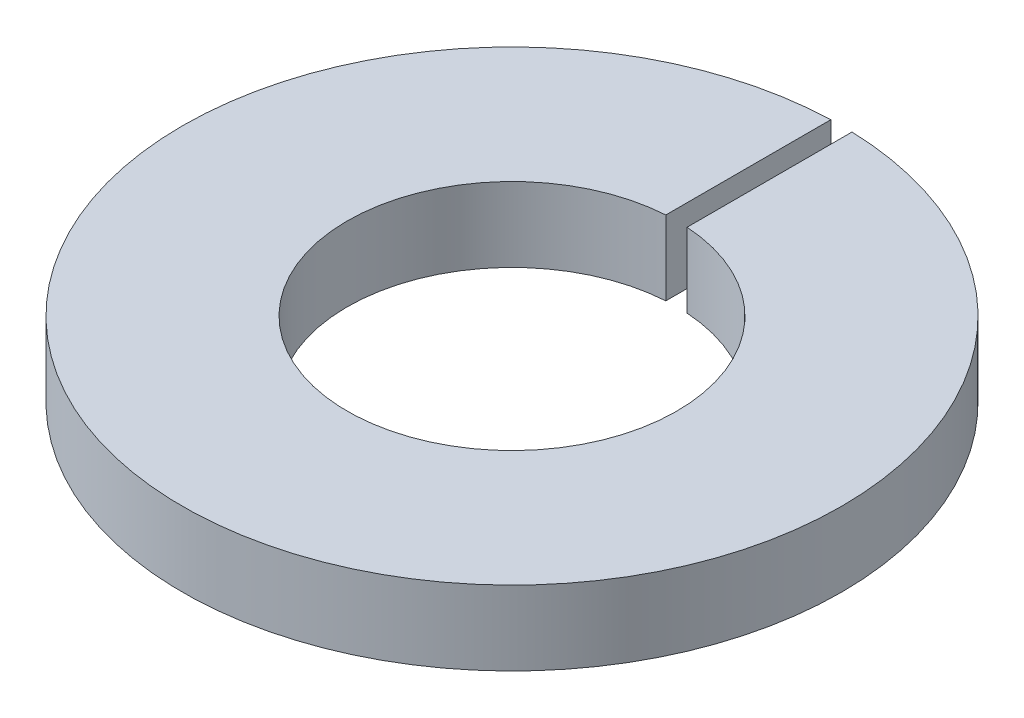
ISO-10303-21;
HEADER;
FILE_DESCRIPTION(('STEP AP214'),'2;1');
FILE_NAME('part.step','',(''),(''),'','','');
FILE_SCHEMA(('AUTOMOTIVE_DESIGN { 1 0 10303 214 1 1 1 1 }'));
ENDSEC;
DATA;
#1=APPLICATION_CONTEXT('core data for automotive mechanical design processes');
#2=APPLICATION_PROTOCOL_DEFINITION('international standard','automotive_design',2000,#1);
#3=PRODUCT_CONTEXT('',#1,'mechanical');
#4=PRODUCT('Part','Part','',(#3));
#5=PRODUCT_RELATED_PRODUCT_CATEGORY('part','',(#4));
#6=PRODUCT_DEFINITION_FORMATION('','',#4);
#7=PRODUCT_DEFINITION_CONTEXT('part definition',#1,'design');
#8=PRODUCT_DEFINITION('design','',#6,#7);
#9=PRODUCT_DEFINITION_SHAPE('','',#8);
#10=(LENGTH_UNIT() NAMED_UNIT(*) SI_UNIT(.MILLI.,.METRE.));
#11=(NAMED_UNIT(*) PLANE_ANGLE_UNIT() SI_UNIT($,.RADIAN.));
#12=(NAMED_UNIT(*) SI_UNIT($,.STERADIAN.) SOLID_ANGLE_UNIT());
#13=UNCERTAINTY_MEASURE_WITH_UNIT(LENGTH_MEASURE(1.E-05),#10,'distance_accuracy_value','');
#14=(GEOMETRIC_REPRESENTATION_CONTEXT(3) GLOBAL_UNCERTAINTY_ASSIGNED_CONTEXT((#13)) GLOBAL_UNIT_ASSIGNED_CONTEXT((#10,
#11,#12)) REPRESENTATION_CONTEXT('',''));
#15=CARTESIAN_POINT('',(0.,0.,0.));
#16=DIRECTION('',(0.,0.,1.));
#17=DIRECTION('',(1.,0.,0.));
#18=AXIS2_PLACEMENT_3D('',#15,#16,#17);
#19=CARTESIAN_POINT('',(0.,0.7,0.));
#20=DIRECTION('',(0.,-1.,0.));
#21=DIRECTION('',(0.,0.,-1.));
#22=AXIS2_PLACEMENT_3D('',#19,#20,#21);
#23=CYLINDRICAL_SURFACE('',#22,1.55);
#24=CARTESIAN_POINT('',(0.,0.,0.));
#25=DIRECTION('',(0.,-1.,0.));
#26=DIRECTION('',(0.,0.,1.));
#27=AXIS2_PLACEMENT_3D('',#24,#25,#26);
#28=CIRCLE('',#27,1.55);
#29=CARTESIAN_POINT('',(0.100000000000001,0.,-1.5467708298258));
#30=VERTEX_POINT('',#29);
#31=CARTESIAN_POINT('',(-0.0999999999999989,0.,-1.5467708298258));
#32=VERTEX_POINT('',#31);
#33=EDGE_CURVE('E107',#30,#32,#28,.T.);
#34=ORIENTED_EDGE('',*,*,#33,.T.);
#35=DIRECTION('',(0.,-1.,0.));
#36=VECTOR('',#35,1.);
#37=CARTESIAN_POINT('',(-0.0999999999999989,0.7,-1.5467708298258));
#38=LINE('',#37,#36);
#39=CARTESIAN_POINT('',(-0.0999999999999989,0.7,-1.5467708298258));
#40=VERTEX_POINT('',#39);
#41=EDGE_CURVE('E11',#40,#32,#38,.T.);
#42=ORIENTED_EDGE('',*,*,#41,.F.);
#43=CARTESIAN_POINT('',(0.,0.7,0.));
#44=DIRECTION('',(0.,-1.,0.));
#45=DIRECTION('',(0.,0.,1.));
#46=AXIS2_PLACEMENT_3D('',#43,#44,#45);
#47=CIRCLE('',#46,1.55);
#48=CARTESIAN_POINT('',(0.100000000000001,0.7,-1.5467708298258));
#49=VERTEX_POINT('',#48);
#50=EDGE_CURVE('E91',#49,#40,#47,.T.);
#51=ORIENTED_EDGE('',*,*,#50,.F.);
#52=DIRECTION('',(0.,-1.,0.));
#53=VECTOR('',#52,1.);
#54=CARTESIAN_POINT('',(0.100000000000001,0.7,-1.5467708298258));
#55=LINE('',#54,#53);
#56=EDGE_CURVE('E103',#49,#30,#55,.T.);
#57=ORIENTED_EDGE('',*,*,#56,.T.);
#58=EDGE_LOOP('',(#34,#42,#51,#57));
#59=FACE_BOUND('',#58,.T.);
#60=ADVANCED_FACE('F39',(#59),#23,.F.);
#61=CARTESIAN_POINT('',(-0.0999999999999989,0.7,-3.09838667696593));
#62=DIRECTION('',(-1.,0.,0.));
#63=DIRECTION('',(0.,0.,1.));
#64=AXIS2_PLACEMENT_3D('',#61,#62,#63);
#65=PLANE('',#64);
#66=DIRECTION('',(0.,0.,-1.));
#67=VECTOR('',#66,1.);
#68=CARTESIAN_POINT('',(-0.0999999999999989,0.,-3.09838667696593));
#69=LINE('',#68,#67);
#70=CARTESIAN_POINT('',(-0.0999999999999989,0.,-3.09838667696593));
#71=VERTEX_POINT('',#70);
#72=EDGE_CURVE('E96',#32,#71,#69,.T.);
#73=ORIENTED_EDGE('',*,*,#72,.T.);
#74=DIRECTION('',(0.,-1.,0.));
#75=VECTOR('',#74,1.);
#76=CARTESIAN_POINT('',(-0.0999999999999989,0.7,-3.09838667696593));
#77=LINE('',#76,#75);
#78=CARTESIAN_POINT('',(-0.0999999999999989,0.7,-3.09838667696593));
#79=VERTEX_POINT('',#78);
#80=EDGE_CURVE('E48',#79,#71,#77,.T.);
#81=ORIENTED_EDGE('',*,*,#80,.F.);
#82=DIRECTION('',(0.,0.,-1.));
#83=VECTOR('',#82,1.);
#84=CARTESIAN_POINT('',(-0.0999999999999989,0.7,-3.09838667696593));
#85=LINE('',#84,#83);
#86=EDGE_CURVE('E86',#40,#79,#85,.T.);
#87=ORIENTED_EDGE('',*,*,#86,.F.);
#88=ORIENTED_EDGE('',*,*,#41,.T.);
#89=EDGE_LOOP('',(#73,#81,#87,#88));
#90=FACE_BOUND('',#89,.T.);
#91=ADVANCED_FACE('F95',(#90),#65,.F.);
#92=CARTESIAN_POINT('',(0.,0.7,0.));
#93=DIRECTION('',(0.,-1.,0.));
#94=DIRECTION('',(0.,0.,-1.));
#95=AXIS2_PLACEMENT_3D('',#92,#93,#94);
#96=CYLINDRICAL_SURFACE('',#95,3.1);
#97=CARTESIAN_POINT('',(0.,0.,0.));
#98=DIRECTION('',(0.,1.,0.));
#99=DIRECTION('',(0.,0.,1.));
#100=AXIS2_PLACEMENT_3D('',#97,#98,#99);
#101=CIRCLE('',#100,3.1);
#102=CARTESIAN_POINT('',(0.100000000000003,0.,-3.09838667696593));
#103=VERTEX_POINT('',#102);
#104=EDGE_CURVE('E73',#71,#103,#101,.T.);
#105=ORIENTED_EDGE('',*,*,#104,.T.);
#106=DIRECTION('',(0.,-1.,0.));
#107=VECTOR('',#106,1.);
#108=CARTESIAN_POINT('',(0.100000000000003,0.7,-3.09838667696593));
#109=LINE('',#108,#107);
#110=CARTESIAN_POINT('',(0.100000000000003,0.7,-3.09838667696593));
#111=VERTEX_POINT('',#110);
#112=EDGE_CURVE('E98',#111,#103,#109,.T.);
#113=ORIENTED_EDGE('',*,*,#112,.F.);
#114=CARTESIAN_POINT('',(0.,0.7,0.));
#115=DIRECTION('',(0.,1.,0.));
#116=DIRECTION('',(0.,0.,1.));
#117=AXIS2_PLACEMENT_3D('',#114,#115,#116);
#118=CIRCLE('',#117,3.1);
#119=EDGE_CURVE('E89',#79,#111,#118,.T.);
#120=ORIENTED_EDGE('',*,*,#119,.F.);
#121=ORIENTED_EDGE('',*,*,#80,.T.);
#122=EDGE_LOOP('',(#105,#113,#120,#121));
#123=FACE_BOUND('',#122,.T.);
#124=ADVANCED_FACE('F99',(#123),#96,.T.);
#125=CARTESIAN_POINT('',(0.100000000000001,0.7,-3.09838667696593));
#126=DIRECTION('',(1.,0.,0.));
#127=DIRECTION('',(0.,0.,-1.));
#128=AXIS2_PLACEMENT_3D('',#125,#126,#127);
#129=PLANE('',#128);
#130=DIRECTION('',(0.,0.,1.));
#131=VECTOR('',#130,1.);
#132=CARTESIAN_POINT('',(0.100000000000001,0.,-3.09838667696593));
#133=LINE('',#132,#131);
#134=EDGE_CURVE('E79',#103,#30,#133,.T.);
#135=ORIENTED_EDGE('',*,*,#134,.T.);
#136=ORIENTED_EDGE('',*,*,#56,.F.);
#137=DIRECTION('',(0.,0.,1.));
#138=VECTOR('',#137,1.);
#139=CARTESIAN_POINT('',(0.100000000000001,0.7,-3.09838667696593));
#140=LINE('',#139,#138);
#141=EDGE_CURVE('E56',#111,#49,#140,.T.);
#142=ORIENTED_EDGE('',*,*,#141,.F.);
#143=ORIENTED_EDGE('',*,*,#112,.T.);
#144=EDGE_LOOP('',(#135,#136,#142,#143));
#145=FACE_BOUND('',#144,.T.);
#146=ADVANCED_FACE('F120',(#145),#129,.F.);
#147=CARTESIAN_POINT('',(0.,0.7,0.));
#148=DIRECTION('',(0.,1.,0.));
#149=DIRECTION('',(0.,0.,1.));
#150=AXIS2_PLACEMENT_3D('',#147,#148,#149);
#151=PLANE('',#150);
#152=ORIENTED_EDGE('',*,*,#50,.T.);
#153=ORIENTED_EDGE('',*,*,#86,.T.);
#154=ORIENTED_EDGE('',*,*,#119,.T.);
#155=ORIENTED_EDGE('',*,*,#141,.T.);
#156=EDGE_LOOP('',(#152,#153,#154,#155));
#157=FACE_BOUND('',#156,.T.);
#158=ADVANCED_FACE('F87',(#157),#151,.T.);
#159=CARTESIAN_POINT('',(0.,0.,0.));
#160=DIRECTION('',(0.,1.,0.));
#161=DIRECTION('',(0.,0.,1.));
#162=AXIS2_PLACEMENT_3D('',#159,#160,#161);
#163=PLANE('',#162);
#164=ORIENTED_EDGE('',*,*,#33,.F.);
#165=ORIENTED_EDGE('',*,*,#134,.F.);
#166=ORIENTED_EDGE('',*,*,#104,.F.);
#167=ORIENTED_EDGE('',*,*,#72,.F.);
#168=EDGE_LOOP('',(#164,#165,#166,#167));
#169=FACE_BOUND('',#168,.T.);
#170=ADVANCED_FACE('F123',(#169),#163,.F.);
#171=CLOSED_SHELL('',(#60,#91,#124,#146,#158,#170));
#172=MANIFOLD_SOLID_BREP('B2',#171);
#173=ADVANCED_BREP_SHAPE_REPRESENTATION('',(#18,#172),#14);
#174=SHAPE_DEFINITION_REPRESENTATION(#9,#173);
ENDSEC;
END-ISO-10303-21;
